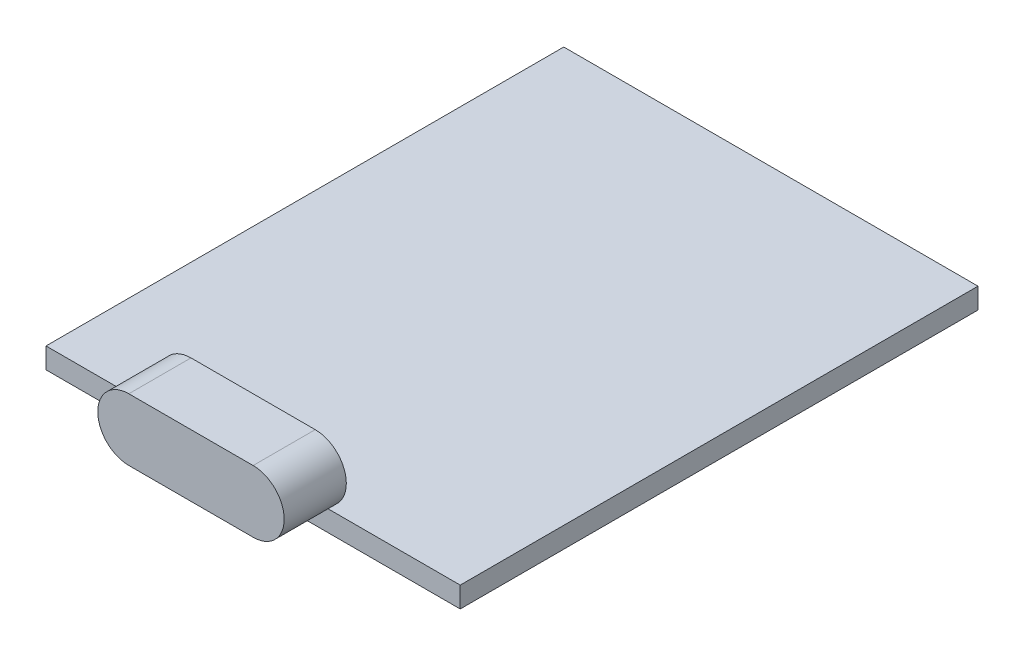
ISO-10303-21;
HEADER;
FILE_DESCRIPTION(('STEP AP214'),'2;1');
FILE_NAME('part.step','',(''),(''),'','','');
FILE_SCHEMA(('AUTOMOTIVE_DESIGN { 1 0 10303 214 1 1 1 1 }'));
ENDSEC;
DATA;
#1=APPLICATION_CONTEXT('core data for automotive mechanical design processes');
#2=APPLICATION_PROTOCOL_DEFINITION('international standard','automotive_design',2000,#1);
#3=PRODUCT_CONTEXT('',#1,'mechanical');
#4=PRODUCT('Part','Part','',(#3));
#5=PRODUCT_RELATED_PRODUCT_CATEGORY('part','',(#4));
#6=PRODUCT_DEFINITION_FORMATION('','',#4);
#7=PRODUCT_DEFINITION_CONTEXT('part definition',#1,'design');
#8=PRODUCT_DEFINITION('design','',#6,#7);
#9=PRODUCT_DEFINITION_SHAPE('','',#8);
#10=(LENGTH_UNIT() NAMED_UNIT(*) SI_UNIT(.MILLI.,.METRE.));
#11=(NAMED_UNIT(*) PLANE_ANGLE_UNIT() SI_UNIT($,.RADIAN.));
#12=(NAMED_UNIT(*) SI_UNIT($,.STERADIAN.) SOLID_ANGLE_UNIT());
#13=UNCERTAINTY_MEASURE_WITH_UNIT(LENGTH_MEASURE(1.E-05),#10,'distance_accuracy_value','');
#14=(GEOMETRIC_REPRESENTATION_CONTEXT(3) GLOBAL_UNCERTAINTY_ASSIGNED_CONTEXT((#13)) GLOBAL_UNIT_ASSIGNED_CONTEXT((#10,
#11,#12)) REPRESENTATION_CONTEXT('',''));
#15=CARTESIAN_POINT('',(0.,0.,0.));
#16=DIRECTION('',(0.,0.,1.));
#17=DIRECTION('',(1.,0.,0.));
#18=AXIS2_PLACEMENT_3D('',#15,#16,#17);
#19=CARTESIAN_POINT('',(0.,1.,15.5));
#20=DIRECTION('',(0.,-1.,0.));
#21=DIRECTION('',(0.,0.,-1.));
#22=AXIS2_PLACEMENT_3D('',#19,#20,#21);
#23=PLANE('',#22);
#24=DIRECTION('',(-1.,0.,0.));
#25=VECTOR('',#24,1.);
#26=CARTESIAN_POINT('',(0.,1.,12.5));
#27=LINE('',#26,#25);
#28=CARTESIAN_POINT('',(3.,1.,12.5));
#29=VERTEX_POINT('',#28);
#30=CARTESIAN_POINT('',(-3.,1.,12.5));
#31=VERTEX_POINT('',#30);
#32=EDGE_CURVE('E108',#29,#31,#27,.T.);
#33=ORIENTED_EDGE('',*,*,#32,.F.);
#34=DIRECTION('',(0.,0.,-1.));
#35=VECTOR('',#34,1.);
#36=CARTESIAN_POINT('',(3.,1.,15.5));
#37=LINE('',#36,#35);
#38=CARTESIAN_POINT('',(3.,1.,15.5));
#39=VERTEX_POINT('',#38);
#40=EDGE_CURVE('E12',#39,#29,#37,.T.);
#41=ORIENTED_EDGE('',*,*,#40,.F.);
#42=DIRECTION('',(-1.,0.,0.));
#43=VECTOR('',#42,1.);
#44=CARTESIAN_POINT('',(0.,1.,15.5));
#45=LINE('',#44,#43);
#46=CARTESIAN_POINT('',(-3.,1.,15.5));
#47=VERTEX_POINT('',#46);
#48=EDGE_CURVE('E93',#39,#47,#45,.T.);
#49=ORIENTED_EDGE('',*,*,#48,.T.);
#50=DIRECTION('',(0.,0.,-1.));
#51=VECTOR('',#50,1.);
#52=CARTESIAN_POINT('',(-3.,1.,15.5));
#53=LINE('',#52,#51);
#54=EDGE_CURVE('E83',#47,#31,#53,.T.);
#55=ORIENTED_EDGE('',*,*,#54,.T.);
#56=EDGE_LOOP('',(#33,#41,#49,#55));
#57=FACE_BOUND('',#56,.T.);
#58=ADVANCED_FACE('F45',(#57),#23,.T.);
#59=CARTESIAN_POINT('',(3.,2.5,15.5));
#60=DIRECTION('',(0.,0.,-1.));
#61=DIRECTION('',(-1.,0.,0.));
#62=AXIS2_PLACEMENT_3D('',#59,#60,#61);
#63=CYLINDRICAL_SURFACE('',#62,1.5);
#64=CARTESIAN_POINT('',(3.,2.5,12.5));
#65=DIRECTION('',(0.,0.,1.));
#66=DIRECTION('',(1.,0.,0.));
#67=AXIS2_PLACEMENT_3D('',#64,#65,#66);
#68=CIRCLE('',#67,1.5);
#69=CARTESIAN_POINT('',(3.,4.,12.5));
#70=VERTEX_POINT('',#69);
#71=EDGE_CURVE('E99',#29,#70,#68,.T.);
#72=ORIENTED_EDGE('',*,*,#71,.T.);
#73=DIRECTION('',(0.,0.,-1.));
#74=VECTOR('',#73,1.);
#75=CARTESIAN_POINT('',(3.,4.,15.5));
#76=LINE('',#75,#74);
#77=CARTESIAN_POINT('',(3.,4.,15.5));
#78=VERTEX_POINT('',#77);
#79=EDGE_CURVE('E53',#78,#70,#76,.T.);
#80=ORIENTED_EDGE('',*,*,#79,.F.);
#81=CARTESIAN_POINT('',(3.,2.5,15.5));
#82=DIRECTION('',(0.,0.,1.));
#83=DIRECTION('',(1.,0.,0.));
#84=AXIS2_PLACEMENT_3D('',#81,#82,#83);
#85=CIRCLE('',#84,1.5);
#86=EDGE_CURVE('E88',#39,#78,#85,.T.);
#87=ORIENTED_EDGE('',*,*,#86,.F.);
#88=ORIENTED_EDGE('',*,*,#40,.T.);
#89=EDGE_LOOP('',(#72,#80,#87,#88));
#90=FACE_BOUND('',#89,.T.);
#91=ADVANCED_FACE('F97',(#90),#63,.T.);
#92=CARTESIAN_POINT('',(0.,4.,15.5));
#93=DIRECTION('',(0.,1.,0.));
#94=DIRECTION('',(0.,0.,1.));
#95=AXIS2_PLACEMENT_3D('',#92,#93,#94);
#96=PLANE('',#95);
#97=DIRECTION('',(1.,0.,0.));
#98=VECTOR('',#97,1.);
#99=CARTESIAN_POINT('',(0.,4.,12.5));
#100=LINE('',#99,#98);
#101=CARTESIAN_POINT('',(-3.,4.,12.5));
#102=VERTEX_POINT('',#101);
#103=EDGE_CURVE('E112',#102,#70,#100,.T.);
#104=ORIENTED_EDGE('',*,*,#103,.F.);
#105=DIRECTION('',(0.,0.,-1.));
#106=VECTOR('',#105,1.);
#107=CARTESIAN_POINT('',(-3.,4.,15.5));
#108=LINE('',#107,#106);
#109=CARTESIAN_POINT('',(-3.,4.,15.5));
#110=VERTEX_POINT('',#109);
#111=EDGE_CURVE('E76',#110,#102,#108,.T.);
#112=ORIENTED_EDGE('',*,*,#111,.F.);
#113=DIRECTION('',(1.,0.,0.));
#114=VECTOR('',#113,1.);
#115=CARTESIAN_POINT('',(0.,4.,15.5));
#116=LINE('',#115,#114);
#117=EDGE_CURVE('E92',#110,#78,#116,.T.);
#118=ORIENTED_EDGE('',*,*,#117,.T.);
#119=ORIENTED_EDGE('',*,*,#79,.T.);
#120=EDGE_LOOP('',(#104,#112,#118,#119));
#121=FACE_BOUND('',#120,.T.);
#122=ADVANCED_FACE('F103',(#121),#96,.T.);
#123=CARTESIAN_POINT('',(-3.,2.5,15.5));
#124=DIRECTION('',(0.,0.,-1.));
#125=DIRECTION('',(-1.,0.,0.));
#126=AXIS2_PLACEMENT_3D('',#123,#124,#125);
#127=CYLINDRICAL_SURFACE('',#126,1.5);
#128=CARTESIAN_POINT('',(-3.,2.5,12.5));
#129=DIRECTION('',(0.,0.,1.));
#130=DIRECTION('',(1.,0.,0.));
#131=AXIS2_PLACEMENT_3D('',#128,#129,#130);
#132=CIRCLE('',#131,1.5);
#133=EDGE_CURVE('E114',#102,#31,#132,.T.);
#134=ORIENTED_EDGE('',*,*,#133,.T.);
#135=ORIENTED_EDGE('',*,*,#54,.F.);
#136=CARTESIAN_POINT('',(-3.,2.5,15.5));
#137=DIRECTION('',(0.,0.,1.));
#138=DIRECTION('',(1.,0.,0.));
#139=AXIS2_PLACEMENT_3D('',#136,#137,#138);
#140=CIRCLE('',#139,1.5);
#141=EDGE_CURVE('E61',#110,#47,#140,.T.);
#142=ORIENTED_EDGE('',*,*,#141,.F.);
#143=ORIENTED_EDGE('',*,*,#111,.T.);
#144=EDGE_LOOP('',(#134,#135,#142,#143));
#145=FACE_BOUND('',#144,.T.);
#146=ADVANCED_FACE('F124',(#145),#127,.T.);
#147=CARTESIAN_POINT('',(0.,0.,15.5));
#148=DIRECTION('',(0.,0.,1.));
#149=DIRECTION('',(1.,0.,0.));
#150=AXIS2_PLACEMENT_3D('',#147,#148,#149);
#151=PLANE('',#150);
#152=ORIENTED_EDGE('',*,*,#48,.F.);
#153=ORIENTED_EDGE('',*,*,#86,.T.);
#154=ORIENTED_EDGE('',*,*,#117,.F.);
#155=ORIENTED_EDGE('',*,*,#141,.T.);
#156=EDGE_LOOP('',(#152,#153,#154,#155));
#157=FACE_BOUND('',#156,.T.);
#158=ADVANCED_FACE('F90',(#157),#151,.T.);
#159=CARTESIAN_POINT('',(0.,0.,12.5));
#160=DIRECTION('',(0.,0.,1.));
#161=DIRECTION('',(1.,0.,0.));
#162=AXIS2_PLACEMENT_3D('',#159,#160,#161);
#163=PLANE('',#162);
#164=ORIENTED_EDGE('',*,*,#32,.T.);
#165=ORIENTED_EDGE('',*,*,#133,.F.);
#166=ORIENTED_EDGE('',*,*,#103,.T.);
#167=ORIENTED_EDGE('',*,*,#71,.F.);
#168=EDGE_LOOP('',(#164,#165,#166,#167));
#169=FACE_BOUND('',#168,.T.);
#170=ADVANCED_FACE('F129',(#169),#163,.F.);
#171=CLOSED_SHELL('',(#58,#91,#122,#146,#158,#170));
#172=MANIFOLD_SOLID_BREP('B2',#171);
#173=CARTESIAN_POINT('',(-10.,1.,12.5));
#174=DIRECTION('',(1.,0.,0.));
#175=DIRECTION('',(0.,0.,-1.));
#176=AXIS2_PLACEMENT_3D('',#173,#174,#175);
#177=PLANE('',#176);
#178=DIRECTION('',(0.,0.,1.));
#179=VECTOR('',#178,1.);
#180=CARTESIAN_POINT('',(-10.,0.,12.5));
#181=LINE('',#180,#179);
#182=CARTESIAN_POINT('',(-10.,0.,-12.5));
#183=VERTEX_POINT('',#182);
#184=CARTESIAN_POINT('',(-10.,0.,12.5));
#185=VERTEX_POINT('',#184);
#186=EDGE_CURVE('E244',#183,#185,#181,.T.);
#187=ORIENTED_EDGE('',*,*,#186,.T.);
#188=DIRECTION('',(0.,-1.,0.));
#189=VECTOR('',#188,1.);
#190=CARTESIAN_POINT('',(-10.,1.,12.5));
#191=LINE('',#190,#189);
#192=CARTESIAN_POINT('',(-10.,1.,12.5));
#193=VERTEX_POINT('',#192);
#194=EDGE_CURVE('E43',#193,#185,#191,.T.);
#195=ORIENTED_EDGE('',*,*,#194,.F.);
#196=DIRECTION('',(0.,0.,1.));
#197=VECTOR('',#196,1.);
#198=CARTESIAN_POINT('',(-10.,1.,12.5));
#199=LINE('',#198,#197);
#200=CARTESIAN_POINT('',(-10.,1.,-12.5));
#201=VERTEX_POINT('',#200);
#202=EDGE_CURVE('E232',#201,#193,#199,.T.);
#203=ORIENTED_EDGE('',*,*,#202,.F.);
#204=DIRECTION('',(0.,-1.,0.));
#205=VECTOR('',#204,1.);
#206=CARTESIAN_POINT('',(-10.,1.,-12.5));
#207=LINE('',#206,#205);
#208=EDGE_CURVE('E240',#201,#183,#207,.T.);
#209=ORIENTED_EDGE('',*,*,#208,.T.);
#210=EDGE_LOOP('',(#187,#195,#203,#209));
#211=FACE_BOUND('',#210,.T.);
#212=ADVANCED_FACE('F181',(#211),#177,.F.);
#213=CARTESIAN_POINT('',(10.,1.,12.5));
#214=DIRECTION('',(0.,0.,-1.));
#215=DIRECTION('',(-1.,0.,0.));
#216=AXIS2_PLACEMENT_3D('',#213,#214,#215);
#217=PLANE('',#216);
#218=DIRECTION('',(1.,0.,0.));
#219=VECTOR('',#218,1.);
#220=CARTESIAN_POINT('',(10.,0.,12.5));
#221=LINE('',#220,#219);
#222=CARTESIAN_POINT('',(10.,0.,12.5));
#223=VERTEX_POINT('',#222);
#224=EDGE_CURVE('E236',#185,#223,#221,.T.);
#225=ORIENTED_EDGE('',*,*,#224,.T.);
#226=DIRECTION('',(0.,-1.,0.));
#227=VECTOR('',#226,1.);
#228=CARTESIAN_POINT('',(10.,1.,12.5));
#229=LINE('',#228,#227);
#230=CARTESIAN_POINT('',(10.,1.,12.5));
#231=VERTEX_POINT('',#230);
#232=EDGE_CURVE('E189',#231,#223,#229,.T.);
#233=ORIENTED_EDGE('',*,*,#232,.F.);
#234=DIRECTION('',(1.,0.,0.));
#235=VECTOR('',#234,1.);
#236=CARTESIAN_POINT('',(10.,1.,12.5));
#237=LINE('',#236,#235);
#238=EDGE_CURVE('E227',#193,#231,#237,.T.);
#239=ORIENTED_EDGE('',*,*,#238,.F.);
#240=ORIENTED_EDGE('',*,*,#194,.T.);
#241=EDGE_LOOP('',(#225,#233,#239,#240));
#242=FACE_BOUND('',#241,.T.);
#243=ADVANCED_FACE('F235',(#242),#217,.F.);
#244=CARTESIAN_POINT('',(10.,1.,12.5));
#245=DIRECTION('',(-1.,0.,0.));
#246=DIRECTION('',(0.,0.,1.));
#247=AXIS2_PLACEMENT_3D('',#244,#245,#246);
#248=PLANE('',#247);
#249=DIRECTION('',(0.,0.,-1.));
#250=VECTOR('',#249,1.);
#251=CARTESIAN_POINT('',(10.,0.,12.5));
#252=LINE('',#251,#250);
#253=CARTESIAN_POINT('',(10.,0.,-12.5));
#254=VERTEX_POINT('',#253);
#255=EDGE_CURVE('E214',#223,#254,#252,.T.);
#256=ORIENTED_EDGE('',*,*,#255,.T.);
#257=DIRECTION('',(0.,-1.,0.));
#258=VECTOR('',#257,1.);
#259=CARTESIAN_POINT('',(10.,1.,-12.5));
#260=LINE('',#259,#258);
#261=CARTESIAN_POINT('',(10.,1.,-12.5));
#262=VERTEX_POINT('',#261);
#263=EDGE_CURVE('E237',#262,#254,#260,.T.);
#264=ORIENTED_EDGE('',*,*,#263,.F.);
#265=DIRECTION('',(0.,0.,-1.));
#266=VECTOR('',#265,1.);
#267=CARTESIAN_POINT('',(10.,1.,12.5));
#268=LINE('',#267,#266);
#269=EDGE_CURVE('E230',#231,#262,#268,.T.);
#270=ORIENTED_EDGE('',*,*,#269,.F.);
#271=ORIENTED_EDGE('',*,*,#232,.T.);
#272=EDGE_LOOP('',(#256,#264,#270,#271));
#273=FACE_BOUND('',#272,.T.);
#274=ADVANCED_FACE('F238',(#273),#248,.F.);
#275=CARTESIAN_POINT('',(10.,1.,-12.5));
#276=DIRECTION('',(0.,0.,1.));
#277=DIRECTION('',(1.,0.,0.));
#278=AXIS2_PLACEMENT_3D('',#275,#276,#277);
#279=PLANE('',#278);
#280=DIRECTION('',(-1.,0.,0.));
#281=VECTOR('',#280,1.);
#282=CARTESIAN_POINT('',(10.,0.,-12.5));
#283=LINE('',#282,#281);
#284=EDGE_CURVE('E220',#254,#183,#283,.T.);
#285=ORIENTED_EDGE('',*,*,#284,.T.);
#286=ORIENTED_EDGE('',*,*,#208,.F.);
#287=DIRECTION('',(-1.,0.,0.));
#288=VECTOR('',#287,1.);
#289=CARTESIAN_POINT('',(10.,1.,-12.5));
#290=LINE('',#289,#288);
#291=EDGE_CURVE('E197',#262,#201,#290,.T.);
#292=ORIENTED_EDGE('',*,*,#291,.F.);
#293=ORIENTED_EDGE('',*,*,#263,.T.);
#294=EDGE_LOOP('',(#285,#286,#292,#293));
#295=FACE_BOUND('',#294,.T.);
#296=ADVANCED_FACE('F251',(#295),#279,.F.);
#297=CARTESIAN_POINT('',(0.,1.,0.));
#298=DIRECTION('',(0.,1.,0.));
#299=DIRECTION('',(0.,0.,1.));
#300=AXIS2_PLACEMENT_3D('',#297,#298,#299);
#301=PLANE('',#300);
#302=ORIENTED_EDGE('',*,*,#202,.T.);
#303=ORIENTED_EDGE('',*,*,#238,.T.);
#304=ORIENTED_EDGE('',*,*,#269,.T.);
#305=ORIENTED_EDGE('',*,*,#291,.T.);
#306=EDGE_LOOP('',(#302,#303,#304,#305));
#307=FACE_BOUND('',#306,.T.);
#308=ADVANCED_FACE('F228',(#307),#301,.T.);
#309=CARTESIAN_POINT('',(0.,0.,0.));
#310=DIRECTION('',(0.,1.,0.));
#311=DIRECTION('',(0.,0.,1.));
#312=AXIS2_PLACEMENT_3D('',#309,#310,#311);
#313=PLANE('',#312);
#314=ORIENTED_EDGE('',*,*,#186,.F.);
#315=ORIENTED_EDGE('',*,*,#284,.F.);
#316=ORIENTED_EDGE('',*,*,#255,.F.);
#317=ORIENTED_EDGE('',*,*,#224,.F.);
#318=EDGE_LOOP('',(#314,#315,#316,#317));
#319=FACE_BOUND('',#318,.T.);
#320=ADVANCED_FACE('F254',(#319),#313,.F.);
#321=CLOSED_SHELL('',(#212,#243,#274,#296,#308,#320));
#322=MANIFOLD_SOLID_BREP('B6',#321);
#323=ADVANCED_BREP_SHAPE_REPRESENTATION('',(#18,#172,#322),#14);
#324=SHAPE_DEFINITION_REPRESENTATION(#9,#323);
ENDSEC;
END-ISO-10303-21;
